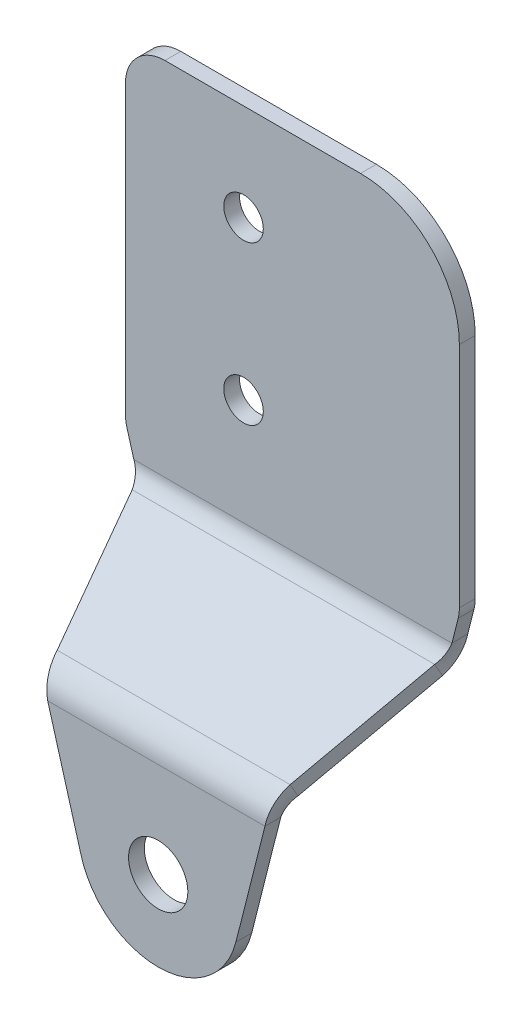
ISO-10303-21;
HEADER;
FILE_DESCRIPTION(('STEP AP214'),'2;1');
FILE_NAME('part.step','',(''),(''),'','','');
FILE_SCHEMA(('AUTOMOTIVE_DESIGN { 1 0 10303 214 1 1 1 1 }'));
ENDSEC;
DATA;
#1=APPLICATION_CONTEXT('core data for automotive mechanical design processes');
#2=APPLICATION_PROTOCOL_DEFINITION('international standard','automotive_design',2000,#1);
#3=PRODUCT_CONTEXT('',#1,'mechanical');
#4=PRODUCT('Part','Part','',(#3));
#5=PRODUCT_RELATED_PRODUCT_CATEGORY('part','',(#4));
#6=PRODUCT_DEFINITION_FORMATION('','',#4);
#7=PRODUCT_DEFINITION_CONTEXT('part definition',#1,'design');
#8=PRODUCT_DEFINITION('design','',#6,#7);
#9=PRODUCT_DEFINITION_SHAPE('','',#8);
#10=(LENGTH_UNIT() NAMED_UNIT(*) SI_UNIT(.MILLI.,.METRE.));
#11=(NAMED_UNIT(*) PLANE_ANGLE_UNIT() SI_UNIT($,.RADIAN.));
#12=(NAMED_UNIT(*) SI_UNIT($,.STERADIAN.) SOLID_ANGLE_UNIT());
#13=UNCERTAINTY_MEASURE_WITH_UNIT(LENGTH_MEASURE(1.E-05),#10,'distance_accuracy_value','');
#14=(GEOMETRIC_REPRESENTATION_CONTEXT(3) GLOBAL_UNCERTAINTY_ASSIGNED_CONTEXT((#13)) GLOBAL_UNIT_ASSIGNED_CONTEXT((#10,
#11,#12)) REPRESENTATION_CONTEXT('',''));
#15=CARTESIAN_POINT('',(0.,0.,0.));
#16=DIRECTION('',(0.,0.,1.));
#17=DIRECTION('',(1.,0.,0.));
#18=AXIS2_PLACEMENT_3D('',#15,#16,#17);
#19=CARTESIAN_POINT('',(280.129035475283,84.9102335013222,5.34114836653676));
#20=DIRECTION('',(0.,-0.86602540378444,-0.499999999999998));
#21=DIRECTION('',(-1.,0.,0.));
#22=AXIS2_PLACEMENT_3D('',#19,#20,#21);
#23=PLANE('',#22);
#24=DIRECTION('',(0.274438872254678,-0.480802273651959,0.832773966359832));
#25=VECTOR('',#24,1.);
#26=CARTESIAN_POINT('',(271.490097915792,92.6607239602693,-8.08309489193763));
#27=LINE('',#26,#25);
#28=CARTESIAN_POINT('',(272.256148777322,91.3186436896052,-5.75854367531156));
#29=VERTEX_POINT('',#28);
#30=CARTESIAN_POINT('',(274.120909693954,88.0516819754429,-0.100000000000003));
#31=VERTEX_POINT('',#30);
#32=EDGE_CURVE('E92',#29,#31,#27,.T.);
#33=ORIENTED_EDGE('',*,*,#32,.T.);
#34=DIRECTION('',(1.,0.,0.));
#35=VECTOR('',#34,1.);
#36=CARTESIAN_POINT('',(280.129035475283,88.0516819754429,-0.100000000000003));
#37=LINE('',#36,#35);
#38=CARTESIAN_POINT('',(285.903200810291,88.0516819754429,-0.100000000000003));
#39=VERTEX_POINT('',#38);
#40=EDGE_CURVE('E85',#31,#39,#37,.T.);
#41=ORIENTED_EDGE('',*,*,#40,.T.);
#42=DIRECTION('',(0.245522578997895,0.484695436125155,-0.839517121565528));
#43=VECTOR('',#42,1.);
#44=CARTESIAN_POINT('',(288.244841789054,92.6744042524836,-8.10678985311503));
#45=LINE('',#44,#43);
#46=CARTESIAN_POINT('',(287.558080979911,91.3186436896052,-5.75854367531156));
#47=VERTEX_POINT('',#46);
#48=EDGE_CURVE('E100',#39,#47,#45,.T.);
#49=ORIENTED_EDGE('',*,*,#48,.T.);
#50=DIRECTION('',(1.,0.,0.));
#51=VECTOR('',#50,1.);
#52=CARTESIAN_POINT('',(280.129035475283,91.3186436896052,-5.75854367531156));
#53=LINE('',#52,#51);
#54=EDGE_CURVE('E408',#29,#47,#53,.T.);
#55=ORIENTED_EDGE('',*,*,#54,.F.);
#56=EDGE_LOOP('',(#33,#41,#49,#55));
#57=FACE_BOUND('',#56,.T.);
#58=ADVANCED_FACE('F73',(#57),#23,.F.);
#59=CARTESIAN_POINT('',(280.129035475283,77.9017721451483,-6.25854367531156));
#60=DIRECTION('',(0.,0.,-1.));
#61=DIRECTION('',(-1.,0.,0.));
#62=AXIS2_PLACEMENT_3D('',#59,#60,#61);
#63=PLANE('',#62);
#64=CARTESIAN_POINT('',(277.387391499222,105.561844598402,-6.25854367531155));
#65=DIRECTION('',(0.,0.,1.));
#66=DIRECTION('',(1.,0.,0.));
#67=AXIS2_PLACEMENT_3D('',#64,#65,#66);
#68=CIRCLE('',#67,0.999999999999998);
#69=CARTESIAN_POINT('',(278.387391499222,105.561844598402,-6.25854367531155));
#70=VERTEX_POINT('',#69);
#71=EDGE_CURVE('E487',#70,#70,#68,.T.);
#72=ORIENTED_EDGE('',*,*,#71,.F.);
#73=EDGE_LOOP('',(#72));
#74=FACE_BOUND('',#73,.T.);
#75=CARTESIAN_POINT('',(277.387391499222,97.5618445984017,-6.25854367531158));
#76=DIRECTION('',(0.,0.,1.));
#77=DIRECTION('',(1.,0.,0.));
#78=AXIS2_PLACEMENT_3D('',#75,#76,#77);
#79=CIRCLE('',#78,0.999999999999998);
#80=CARTESIAN_POINT('',(278.387391499222,97.5618445984017,-6.25854367531158));
#81=VERTEX_POINT('',#80);
#82=EDGE_CURVE('E482',#81,#81,#79,.T.);
#83=ORIENTED_EDGE('',*,*,#82,.F.);
#84=EDGE_LOOP('',(#83));
#85=FACE_BOUND('',#84,.T.);
#86=DIRECTION('',(0.274438872254678,-0.961604547303922,0.));
#87=VECTOR('',#86,1.);
#88=CARTESIAN_POINT('',(271.490097915792,93.4027530630427,-6.25854367531156));
#89=LINE('',#88,#87);
#90=CARTESIAN_POINT('',(271.490097915792,93.4027530630427,-6.25854367531156));
#91=VERTEX_POINT('',#90);
#92=CARTESIAN_POINT('',(271.837735197542,92.1846690933896,-6.25854367531155));
#93=VERTEX_POINT('',#92);
#94=EDGE_CURVE('E479',#91,#93,#89,.T.);
#95=ORIENTED_EDGE('',*,*,#94,.T.);
#96=DIRECTION('',(1.,0.,0.));
#97=VECTOR('',#96,1.);
#98=CARTESIAN_POINT('',(280.129035475283,92.1846690933896,-6.25854367531155));
#99=LINE('',#98,#97);
#100=CARTESIAN_POINT('',(287.929401683654,92.1846690933896,-6.25854367531155));
#101=VERTEX_POINT('',#100);
#102=EDGE_CURVE('E468',#93,#101,#99,.T.);
#103=ORIENTED_EDGE('',*,*,#102,.T.);
#104=DIRECTION('',(0.245522578997895,0.969390872250313,0.));
#105=VECTOR('',#104,1.);
#106=CARTESIAN_POINT('',(288.244841789054,93.4301136474711,-6.25854367531155));
#107=LINE('',#106,#105);
#108=CARTESIAN_POINT('',(288.244841789054,93.4301136474711,-6.25854367531155));
#109=VERTEX_POINT('',#108);
#110=EDGE_CURVE('E485',#101,#109,#107,.T.);
#111=ORIENTED_EDGE('',*,*,#110,.T.);
#112=CARTESIAN_POINT('',(286.306060044553,93.9211588054669,-6.25854367531155));
#113=DIRECTION('',(0.,0.,1.));
#114=DIRECTION('',(1.,0.,0.));
#115=AXIS2_PLACEMENT_3D('',#112,#113,#114);
#116=CIRCLE('',#115,2.);
#117=CARTESIAN_POINT('',(288.306060044553,93.9211588054669,-6.25854367531155));
#118=VERTEX_POINT('',#117);
#119=EDGE_CURVE('E488',#109,#118,#116,.T.);
#120=ORIENTED_EDGE('',*,*,#119,.T.);
#121=DIRECTION('',(0.,1.,0.));
#122=VECTOR('',#121,1.);
#123=CARTESIAN_POINT('',(288.306060044553,77.9017721451483,-6.25854367531156));
#124=LINE('',#123,#122);
#125=CARTESIAN_POINT('',(288.306060044553,105.451630807552,-6.25854367531158));
#126=VERTEX_POINT('',#125);
#127=EDGE_CURVE('E1105',#118,#126,#124,.T.);
#128=ORIENTED_EDGE('',*,*,#127,.T.);
#129=CARTESIAN_POINT('',(283.306060044553,105.451630807552,-6.25854367531158));
#130=DIRECTION('',(0.,0.,1.));
#131=DIRECTION('',(1.,0.,0.));
#132=AXIS2_PLACEMENT_3D('',#129,#130,#131);
#133=CIRCLE('',#132,4.99999999999998);
#134=CARTESIAN_POINT('',(283.306060044553,110.451630807552,-6.25854367531155));
#135=VERTEX_POINT('',#134);
#136=EDGE_CURVE('E1108',#126,#135,#133,.T.);
#137=ORIENTED_EDGE('',*,*,#136,.T.);
#138=DIRECTION('',(-1.,0.,0.));
#139=VECTOR('',#138,1.);
#140=CARTESIAN_POINT('',(280.129035475283,110.451630807552,-6.25854367531155));
#141=LINE('',#140,#139);
#142=CARTESIAN_POINT('',(273.4133070104,110.451630807552,-6.25854367531155));
#143=VERTEX_POINT('',#142);
#144=EDGE_CURVE('E1111',#135,#143,#141,.T.);
#145=ORIENTED_EDGE('',*,*,#144,.T.);
#146=CARTESIAN_POINT('',(273.4133070104,108.451630807552,-6.25854367531156));
#147=DIRECTION('',(0.,0.,1.));
#148=DIRECTION('',(1.,0.,0.));
#149=AXIS2_PLACEMENT_3D('',#146,#147,#148);
#150=CIRCLE('',#149,2.);
#151=CARTESIAN_POINT('',(271.4133070104,108.451630807552,-6.25854367531156));
#152=VERTEX_POINT('',#151);
#153=EDGE_CURVE('E1040',#143,#152,#150,.T.);
#154=ORIENTED_EDGE('',*,*,#153,.T.);
#155=DIRECTION('',(0.,1.,0.));
#156=VECTOR('',#155,1.);
#157=CARTESIAN_POINT('',(271.4133070104,77.9017721451483,-6.25854367531156));
#158=LINE('',#157,#156);
#159=CARTESIAN_POINT('',(271.4133070104,93.9516308075518,-6.25854367531156));
#160=VERTEX_POINT('',#159);
#161=EDGE_CURVE('E1025',#152,#160,#158,.F.);
#162=ORIENTED_EDGE('',*,*,#161,.T.);
#163=CARTESIAN_POINT('',(273.4133070104,93.9516308075518,-6.25854367531156));
#164=DIRECTION('',(0.,0.,1.));
#165=DIRECTION('',(1.,0.,0.));
#166=AXIS2_PLACEMENT_3D('',#163,#164,#165);
#167=CIRCLE('',#166,1.99999999999998);
#168=EDGE_CURVE('E481',#160,#91,#167,.T.);
#169=ORIENTED_EDGE('',*,*,#168,.T.);
#170=EDGE_LOOP('',(#95,#103,#111,#120,#128,#137,#145,#154,#162,#169));
#171=FACE_BOUND('',#170,.T.);
#172=ADVANCED_FACE('F437',(#74,#85,#171),#63,.F.);
#173=CARTESIAN_POINT('',(273.4133070104,93.9516308075518,-7.05854367531156));
#174=DIRECTION('',(0.,0.,-1.));
#175=DIRECTION('',(-1.,0.,0.));
#176=AXIS2_PLACEMENT_3D('',#173,#174,#175);
#177=CYLINDRICAL_SURFACE('',#176,1.99999999999998);
#178=DIRECTION('',(0.,0.,-1.));
#179=VECTOR('',#178,1.);
#180=CARTESIAN_POINT('',(271.490097915792,93.4027530630427,-7.05854367531157));
#181=LINE('',#180,#179);
#182=CARTESIAN_POINT('',(271.490097915792,93.4027530630427,-7.05854367531157));
#183=VERTEX_POINT('',#182);
#184=EDGE_CURVE('E1031',#91,#183,#181,.T.);
#185=ORIENTED_EDGE('',*,*,#184,.F.);
#186=ORIENTED_EDGE('',*,*,#168,.F.);
#187=DIRECTION('',(0.,0.,-1.));
#188=VECTOR('',#187,1.);
#189=CARTESIAN_POINT('',(271.4133070104,93.9516308075518,-7.05854367531156));
#190=LINE('',#189,#188);
#191=CARTESIAN_POINT('',(271.4133070104,93.9516308075518,-7.05854367531156));
#192=VERTEX_POINT('',#191);
#193=EDGE_CURVE('E1023',#160,#192,#190,.T.);
#194=ORIENTED_EDGE('',*,*,#193,.T.);
#195=CARTESIAN_POINT('',(273.4133070104,93.9516308075518,-7.05854367531156));
#196=DIRECTION('',(0.,0.,1.));
#197=DIRECTION('',(-1.,0.,0.));
#198=AXIS2_PLACEMENT_3D('',#195,#196,#197);
#199=CIRCLE('',#198,1.99999999999998);
#200=EDGE_CURVE('E1073',#192,#183,#199,.T.);
#201=ORIENTED_EDGE('',*,*,#200,.T.);
#202=EDGE_LOOP('',(#185,#186,#194,#201));
#203=FACE_BOUND('',#202,.T.);
#204=ADVANCED_FACE('F441',(#203),#177,.T.);
#205=CARTESIAN_POINT('',(271.4133070104,108.451630807552,-7.05854367531156));
#206=DIRECTION('',(1.,0.,0.));
#207=DIRECTION('',(0.,-1.,0.));
#208=AXIS2_PLACEMENT_3D('',#205,#206,#207);
#209=PLANE('',#208);
#210=ORIENTED_EDGE('',*,*,#193,.F.);
#211=ORIENTED_EDGE('',*,*,#161,.F.);
#212=DIRECTION('',(0.,0.,-1.));
#213=VECTOR('',#212,1.);
#214=CARTESIAN_POINT('',(271.4133070104,108.451630807552,-7.05854367531156));
#215=LINE('',#214,#213);
#216=CARTESIAN_POINT('',(271.4133070104,108.451630807552,-7.05854367531156));
#217=VERTEX_POINT('',#216);
#218=EDGE_CURVE('E1032',#152,#217,#215,.T.);
#219=ORIENTED_EDGE('',*,*,#218,.T.);
#220=DIRECTION('',(0.,-1.,0.));
#221=VECTOR('',#220,1.);
#222=CARTESIAN_POINT('',(271.4133070104,108.451630807552,-7.05854367531156));
#223=LINE('',#222,#221);
#224=EDGE_CURVE('E1027',#217,#192,#223,.T.);
#225=ORIENTED_EDGE('',*,*,#224,.T.);
#226=EDGE_LOOP('',(#210,#211,#219,#225));
#227=FACE_BOUND('',#226,.T.);
#228=ADVANCED_FACE('F447',(#227),#209,.F.);
#229=CARTESIAN_POINT('',(273.4133070104,108.451630807552,-7.05854367531156));
#230=DIRECTION('',(0.,0.,-1.));
#231=DIRECTION('',(-1.,0.,0.));
#232=AXIS2_PLACEMENT_3D('',#229,#230,#231);
#233=CYLINDRICAL_SURFACE('',#232,2.);
#234=ORIENTED_EDGE('',*,*,#218,.F.);
#235=ORIENTED_EDGE('',*,*,#153,.F.);
#236=DIRECTION('',(0.,0.,-1.));
#237=VECTOR('',#236,1.);
#238=CARTESIAN_POINT('',(273.4133070104,110.451630807552,-7.05854367531156));
#239=LINE('',#238,#237);
#240=CARTESIAN_POINT('',(273.4133070104,110.451630807552,-7.05854367531156));
#241=VERTEX_POINT('',#240);
#242=EDGE_CURVE('E1058',#143,#241,#239,.T.);
#243=ORIENTED_EDGE('',*,*,#242,.T.);
#244=CARTESIAN_POINT('',(273.4133070104,108.451630807552,-7.05854367531156));
#245=DIRECTION('',(0.,0.,1.));
#246=DIRECTION('',(1.,0.,0.));
#247=AXIS2_PLACEMENT_3D('',#244,#245,#246);
#248=CIRCLE('',#247,2.);
#249=EDGE_CURVE('E1085',#241,#217,#248,.T.);
#250=ORIENTED_EDGE('',*,*,#249,.T.);
#251=EDGE_LOOP('',(#234,#235,#243,#250));
#252=FACE_BOUND('',#251,.T.);
#253=ADVANCED_FACE('F952',(#252),#233,.T.);
#254=CARTESIAN_POINT('',(273.4133070104,110.451630807552,-7.05854367531156));
#255=DIRECTION('',(0.,-1.,0.));
#256=DIRECTION('',(-1.,0.,0.));
#257=AXIS2_PLACEMENT_3D('',#254,#255,#256);
#258=PLANE('',#257);
#259=ORIENTED_EDGE('',*,*,#242,.F.);
#260=ORIENTED_EDGE('',*,*,#144,.F.);
#261=DIRECTION('',(0.,0.,-1.));
#262=VECTOR('',#261,1.);
#263=CARTESIAN_POINT('',(283.306060044553,110.451630807552,-7.05854367531156));
#264=LINE('',#263,#262);
#265=CARTESIAN_POINT('',(283.306060044553,110.451630807552,-7.05854367531156));
#266=VERTEX_POINT('',#265);
#267=EDGE_CURVE('E1056',#135,#266,#264,.T.);
#268=ORIENTED_EDGE('',*,*,#267,.T.);
#269=DIRECTION('',(-1.,0.,0.));
#270=VECTOR('',#269,1.);
#271=CARTESIAN_POINT('',(273.4133070104,110.451630807552,-7.05854367531156));
#272=LINE('',#271,#270);
#273=EDGE_CURVE('E1088',#266,#241,#272,.T.);
#274=ORIENTED_EDGE('',*,*,#273,.T.);
#275=EDGE_LOOP('',(#259,#260,#268,#274));
#276=FACE_BOUND('',#275,.T.);
#277=ADVANCED_FACE('F939',(#276),#258,.F.);
#278=CARTESIAN_POINT('',(283.306060044553,105.451630807552,-7.05854367531156));
#279=DIRECTION('',(0.,0.,-1.));
#280=DIRECTION('',(-1.,0.,0.));
#281=AXIS2_PLACEMENT_3D('',#278,#279,#280);
#282=CYLINDRICAL_SURFACE('',#281,4.99999999999998);
#283=ORIENTED_EDGE('',*,*,#267,.F.);
#284=ORIENTED_EDGE('',*,*,#136,.F.);
#285=DIRECTION('',(0.,0.,-1.));
#286=VECTOR('',#285,1.);
#287=CARTESIAN_POINT('',(288.306060044553,105.451630807552,-7.05854367531156));
#288=LINE('',#287,#286);
#289=CARTESIAN_POINT('',(288.306060044553,105.451630807552,-7.05854367531156));
#290=VERTEX_POINT('',#289);
#291=EDGE_CURVE('E1054',#126,#290,#288,.T.);
#292=ORIENTED_EDGE('',*,*,#291,.T.);
#293=CARTESIAN_POINT('',(283.306060044553,105.451630807552,-7.05854367531156));
#294=DIRECTION('',(0.,0.,1.));
#295=DIRECTION('',(1.,0.,0.));
#296=AXIS2_PLACEMENT_3D('',#293,#294,#295);
#297=CIRCLE('',#296,4.99999999999998);
#298=EDGE_CURVE('E1091',#290,#266,#297,.T.);
#299=ORIENTED_EDGE('',*,*,#298,.T.);
#300=EDGE_LOOP('',(#283,#284,#292,#299));
#301=FACE_BOUND('',#300,.T.);
#302=ADVANCED_FACE('F926',(#301),#282,.T.);
#303=CARTESIAN_POINT('',(288.306060044553,105.451630807552,-7.05854367531156));
#304=DIRECTION('',(-1.,0.,0.));
#305=DIRECTION('',(0.,1.,0.));
#306=AXIS2_PLACEMENT_3D('',#303,#304,#305);
#307=PLANE('',#306);
#308=ORIENTED_EDGE('',*,*,#291,.F.);
#309=ORIENTED_EDGE('',*,*,#127,.F.);
#310=DIRECTION('',(0.,0.,-1.));
#311=VECTOR('',#310,1.);
#312=CARTESIAN_POINT('',(288.306060044553,93.9211588054669,-7.05854367531156));
#313=LINE('',#312,#311);
#314=CARTESIAN_POINT('',(288.306060044553,93.9211588054669,-7.05854367531156));
#315=VERTEX_POINT('',#314);
#316=EDGE_CURVE('E1051',#118,#315,#313,.T.);
#317=ORIENTED_EDGE('',*,*,#316,.T.);
#318=DIRECTION('',(0.,1.,0.));
#319=VECTOR('',#318,1.);
#320=CARTESIAN_POINT('',(288.306060044553,105.451630807552,-7.05854367531156));
#321=LINE('',#320,#319);
#322=EDGE_CURVE('E1094',#315,#290,#321,.T.);
#323=ORIENTED_EDGE('',*,*,#322,.T.);
#324=EDGE_LOOP('',(#308,#309,#317,#323));
#325=FACE_BOUND('',#324,.T.);
#326=ADVANCED_FACE('F914',(#325),#307,.F.);
#327=CARTESIAN_POINT('',(286.306060044553,93.9211588054669,-7.05854367531156));
#328=DIRECTION('',(0.,0.,-1.));
#329=DIRECTION('',(-1.,0.,0.));
#330=AXIS2_PLACEMENT_3D('',#327,#328,#329);
#331=CYLINDRICAL_SURFACE('',#330,2.);
#332=ORIENTED_EDGE('',*,*,#316,.F.);
#333=ORIENTED_EDGE('',*,*,#119,.F.);
#334=DIRECTION('',(0.,0.,-1.));
#335=VECTOR('',#334,1.);
#336=CARTESIAN_POINT('',(288.244841789054,93.4301136474711,-7.05854367531156));
#337=LINE('',#336,#335);
#338=CARTESIAN_POINT('',(288.244841789054,93.4301136474711,-7.05854367531156));
#339=VERTEX_POINT('',#338);
#340=EDGE_CURVE('E1048',#109,#339,#337,.T.);
#341=ORIENTED_EDGE('',*,*,#340,.T.);
#342=CARTESIAN_POINT('',(286.306060044553,93.9211588054669,-7.05854367531156));
#343=DIRECTION('',(0.,0.,1.));
#344=DIRECTION('',(1.,0.,0.));
#345=AXIS2_PLACEMENT_3D('',#342,#343,#344);
#346=CIRCLE('',#345,2.);
#347=EDGE_CURVE('E1065',#339,#315,#346,.T.);
#348=ORIENTED_EDGE('',*,*,#347,.T.);
#349=EDGE_LOOP('',(#332,#333,#341,#348));
#350=FACE_BOUND('',#349,.T.);
#351=ADVANCED_FACE('F903',(#350),#331,.T.);
#352=CARTESIAN_POINT('',(288.244841789054,93.4301136474711,-7.05854367531156));
#353=DIRECTION('',(-0.969390872250313,0.245522578997895,0.));
#354=DIRECTION('',(0.245522578997895,0.969390872250313,0.));
#355=AXIS2_PLACEMENT_3D('',#352,#353,#354);
#356=PLANE('',#355);
#357=CARTESIAN_POINT('',(287.929401683654,92.1846690933897,-7.05854367531156));
#358=CARTESIAN_POINT('',(287.929401683654,92.1846690933897,-6.25854367531156));
#359=B_SPLINE_CURVE_WITH_KNOTS('',1,(#357,#358),.UNSPECIFIED.,.F.,.F.,(2,2),(0.,1.),.UNSPECIFIED.);
#360=CARTESIAN_POINT('',(287.929401683654,92.1846690933897,-7.05854367531156));
#361=VERTEX_POINT('',#360);
#362=EDGE_CURVE('E404',#361,#101,#359,.T.);
#363=ORIENTED_EDGE('',*,*,#362,.F.);
#364=DIRECTION('',(0.245522578997895,0.969390872250313,0.));
#365=VECTOR('',#364,1.);
#366=CARTESIAN_POINT('',(288.244841789054,93.4301136474711,-7.05854367531156));
#367=LINE('',#366,#365);
#368=EDGE_CURVE('E1063',#361,#339,#367,.T.);
#369=ORIENTED_EDGE('',*,*,#368,.T.);
#370=ORIENTED_EDGE('',*,*,#340,.F.);
#371=ORIENTED_EDGE('',*,*,#110,.F.);
#372=EDGE_LOOP('',(#363,#369,#370,#371));
#373=FACE_BOUND('',#372,.T.);
#374=ADVANCED_FACE('F453',(#373),#356,.F.);
#375=CARTESIAN_POINT('',(277.387391499222,97.5618445984017,-7.05854367531156));
#376=DIRECTION('',(0.,0.,-1.));
#377=DIRECTION('',(-1.,0.,0.));
#378=AXIS2_PLACEMENT_3D('',#375,#376,#377);
#379=CYLINDRICAL_SURFACE('',#378,0.999999999999998);
#380=CARTESIAN_POINT('',(277.387391499222,97.5618445984017,-7.05854367531156));
#381=DIRECTION('',(0.,0.,1.));
#382=DIRECTION('',(1.,0.,0.));
#383=AXIS2_PLACEMENT_3D('',#380,#381,#382);
#384=CIRCLE('',#383,0.999999999999998);
#385=CARTESIAN_POINT('',(278.387391499222,97.5618445984017,-7.05854367531156));
#386=VERTEX_POINT('',#385);
#387=EDGE_CURVE('E1047',#386,#386,#384,.T.);
#388=ORIENTED_EDGE('',*,*,#387,.F.);
#389=EDGE_LOOP('',(#388));
#390=FACE_BOUND('',#389,.T.);
#391=ORIENTED_EDGE('',*,*,#82,.T.);
#392=EDGE_LOOP('',(#391));
#393=FACE_BOUND('',#392,.T.);
#394=ADVANCED_FACE('F379',(#390,#393),#379,.F.);
#395=CARTESIAN_POINT('',(271.490097915792,93.4027530630427,-7.05854367531157));
#396=DIRECTION('',(0.961604547303922,0.274438872254678,0.));
#397=DIRECTION('',(0.274438872254678,-0.961604547303922,0.));
#398=AXIS2_PLACEMENT_3D('',#395,#396,#397);
#399=PLANE('',#398);
#400=CARTESIAN_POINT('',(271.837735197542,92.1846690933897,-6.25854367531156));
#401=CARTESIAN_POINT('',(271.837735197542,92.1846690933897,-7.05854367531156));
#402=B_SPLINE_CURVE_WITH_KNOTS('',1,(#400,#401),.UNSPECIFIED.,.F.,.F.,(2,2),(0.,1.),.UNSPECIFIED.);
#403=CARTESIAN_POINT('',(271.837735197542,92.1846690933896,-7.05854367531157));
#404=VERTEX_POINT('',#403);
#405=EDGE_CURVE('E476',#93,#404,#402,.T.);
#406=ORIENTED_EDGE('',*,*,#405,.F.);
#407=ORIENTED_EDGE('',*,*,#94,.F.);
#408=ORIENTED_EDGE('',*,*,#184,.T.);
#409=DIRECTION('',(0.274438872254678,-0.961604547303922,0.));
#410=VECTOR('',#409,1.);
#411=CARTESIAN_POINT('',(271.490097915792,93.4027530630427,-7.05854367531157));
#412=LINE('',#411,#410);
#413=EDGE_CURVE('E1071',#183,#404,#412,.T.);
#414=ORIENTED_EDGE('',*,*,#413,.T.);
#415=EDGE_LOOP('',(#406,#407,#408,#414));
#416=FACE_BOUND('',#415,.T.);
#417=ADVANCED_FACE('F456',(#416),#399,.F.);
#418=CARTESIAN_POINT('',(277.387391499222,105.561844598402,-7.05854367531157));
#419=DIRECTION('',(0.,0.,-1.));
#420=DIRECTION('',(-1.,0.,0.));
#421=AXIS2_PLACEMENT_3D('',#418,#419,#420);
#422=CYLINDRICAL_SURFACE('',#421,0.999999999999998);
#423=CARTESIAN_POINT('',(277.387391499222,105.561844598402,-7.05854367531157));
#424=DIRECTION('',(0.,0.,1.));
#425=DIRECTION('',(1.,0.,0.));
#426=AXIS2_PLACEMENT_3D('',#423,#424,#425);
#427=CIRCLE('',#426,0.999999999999998);
#428=CARTESIAN_POINT('',(278.387391499222,105.561844598402,-7.05854367531157));
#429=VERTEX_POINT('',#428);
#430=EDGE_CURVE('E1052',#429,#429,#427,.T.);
#431=ORIENTED_EDGE('',*,*,#430,.F.);
#432=EDGE_LOOP('',(#431));
#433=FACE_BOUND('',#432,.T.);
#434=ORIENTED_EDGE('',*,*,#71,.T.);
#435=EDGE_LOOP('',(#434));
#436=FACE_BOUND('',#435,.T.);
#437=ADVANCED_FACE('F459',(#433,#436),#422,.F.);
#438=CARTESIAN_POINT('',(280.129035475283,77.9017721451483,-7.05854367531156));
#439=DIRECTION('',(0.,0.,-1.));
#440=DIRECTION('',(-1.,0.,0.));
#441=AXIS2_PLACEMENT_3D('',#438,#439,#440);
#442=PLANE('',#441);
#443=DIRECTION('',(1.,0.,0.));
#444=VECTOR('',#443,1.);
#445=CARTESIAN_POINT('',(280.129035475283,92.1846690933896,-7.05854367531157));
#446=LINE('',#445,#444);
#447=EDGE_CURVE('E1062',#404,#361,#446,.T.);
#448=ORIENTED_EDGE('',*,*,#447,.F.);
#449=ORIENTED_EDGE('',*,*,#413,.F.);
#450=ORIENTED_EDGE('',*,*,#200,.F.);
#451=ORIENTED_EDGE('',*,*,#224,.F.);
#452=ORIENTED_EDGE('',*,*,#249,.F.);
#453=ORIENTED_EDGE('',*,*,#273,.F.);
#454=ORIENTED_EDGE('',*,*,#298,.F.);
#455=ORIENTED_EDGE('',*,*,#322,.F.);
#456=ORIENTED_EDGE('',*,*,#347,.F.);
#457=ORIENTED_EDGE('',*,*,#368,.F.);
#458=EDGE_LOOP('',(#448,#449,#450,#451,#452,#453,#454,#455,#456,#457));
#459=FACE_BOUND('',#458,.T.);
#460=ORIENTED_EDGE('',*,*,#387,.T.);
#461=EDGE_LOOP('',(#460));
#462=FACE_BOUND('',#461,.T.);
#463=ORIENTED_EDGE('',*,*,#430,.T.);
#464=EDGE_LOOP('',(#463));
#465=FACE_BOUND('',#464,.T.);
#466=ADVANCED_FACE('F846',(#459,#462,#465),#442,.T.);
#467=CARTESIAN_POINT('',(280.129035475283,84.2174131782946,4.94114836653677));
#468=DIRECTION('',(0.,-0.86602540378444,-0.499999999999998));
#469=DIRECTION('',(-1.,0.,0.));
#470=AXIS2_PLACEMENT_3D('',#467,#468,#469);
#471=PLANE('',#470);
#472=DIRECTION('',(1.,0.,0.));
#473=VECTOR('',#472,1.);
#474=CARTESIAN_POINT('',(280.129035475283,87.3588616524153,-0.5));
#475=LINE('',#474,#473);
#476=CARTESIAN_POINT('',(274.120909693954,87.3588616524153,-0.5));
#477=VERTEX_POINT('',#476);
#478=CARTESIAN_POINT('',(285.903200810291,87.3588616524153,-0.500000000000006));
#479=VERTEX_POINT('',#478);
#480=EDGE_CURVE('E230',#477,#479,#475,.T.);
#481=ORIENTED_EDGE('',*,*,#480,.F.);
#482=DIRECTION('',(0.274438872254678,-0.480802273651959,0.832773966359832));
#483=VECTOR('',#482,1.);
#484=CARTESIAN_POINT('',(271.490097915792,91.9679036372418,-8.48309489193763));
#485=LINE('',#484,#483);
#486=CARTESIAN_POINT('',(272.256148777322,90.6258233665776,-6.15854367531156));
#487=VERTEX_POINT('',#486);
#488=EDGE_CURVE('E534',#487,#477,#485,.T.);
#489=ORIENTED_EDGE('',*,*,#488,.F.);
#490=DIRECTION('',(1.,0.,0.));
#491=VECTOR('',#490,1.);
#492=CARTESIAN_POINT('',(280.129035475283,90.6258233665776,-6.15854367531156));
#493=LINE('',#492,#491);
#494=CARTESIAN_POINT('',(287.558080979911,90.6258233665776,-6.15854367531156));
#495=VERTEX_POINT('',#494);
#496=EDGE_CURVE('E415',#487,#495,#493,.T.);
#497=ORIENTED_EDGE('',*,*,#496,.T.);
#498=DIRECTION('',(0.245522578997895,0.484695436125155,-0.839517121565528));
#499=VECTOR('',#498,1.);
#500=CARTESIAN_POINT('',(288.244841789054,91.981583929456,-8.50678985311502));
#501=LINE('',#500,#499);
#502=EDGE_CURVE('E497',#479,#495,#501,.T.);
#503=ORIENTED_EDGE('',*,*,#502,.F.);
#504=EDGE_LOOP('',(#481,#489,#497,#503));
#505=FACE_BOUND('',#504,.T.);
#506=ADVANCED_FACE('F433',(#505),#471,.T.);
#507=CARTESIAN_POINT('',(288.244841789054,91.981583929456,-8.50678985311502));
#508=DIRECTION('',(-0.969390872250313,0.122761289498947,-0.212628790614849));
#509=DIRECTION('',(0.245522578997895,0.484695436125155,-0.839517121565528));
#510=AXIS2_PLACEMENT_3D('',#507,#508,#509);
#511=PLANE('',#510);
#512=CARTESIAN_POINT('',(285.903200810291,87.3588616524153,-0.500000000000006));
#513=CARTESIAN_POINT('',(285.903200810291,88.0516819754429,-0.100000000000011));
#514=B_SPLINE_CURVE_WITH_KNOTS('',1,(#512,#513),.UNSPECIFIED.,.F.,.F.,(2,2),(0.,1.),.UNSPECIFIED.);
#515=EDGE_CURVE('E512',#479,#39,#514,.T.);
#516=ORIENTED_EDGE('',*,*,#515,.F.);
#517=ORIENTED_EDGE('',*,*,#502,.T.);
#518=CARTESIAN_POINT('',(287.558080979911,91.3186436896052,-5.75854367531156));
#519=CARTESIAN_POINT('',(287.558080979911,90.6258233665776,-6.15854367531156));
#520=B_SPLINE_CURVE_WITH_KNOTS('',1,(#518,#519),.UNSPECIFIED.,.F.,.F.,(2,2),(0.,1.),.UNSPECIFIED.);
#521=EDGE_CURVE('E419',#495,#47,#520,.F.);
#522=ORIENTED_EDGE('',*,*,#521,.T.);
#523=ORIENTED_EDGE('',*,*,#48,.F.);
#524=EDGE_LOOP('',(#516,#517,#522,#523));
#525=FACE_BOUND('',#524,.T.);
#526=ADVANCED_FACE('F424',(#525),#511,.F.);
#527=CARTESIAN_POINT('',(271.490097915792,91.9679036372418,-8.48309489193763));
#528=DIRECTION('',(0.961604547303922,0.137219436127339,-0.237671035158504));
#529=DIRECTION('',(0.274438872254678,-0.480802273651959,0.832773966359832));
#530=AXIS2_PLACEMENT_3D('',#527,#528,#529);
#531=PLANE('',#530);
#532=CARTESIAN_POINT('',(274.120909693954,88.0516819754429,-0.100000000000011));
#533=CARTESIAN_POINT('',(274.120909693954,87.3588616524153,-0.500000000000006));
#534=B_SPLINE_CURVE_WITH_KNOTS('',1,(#532,#533),.UNSPECIFIED.,.F.,.F.,(2,2),(0.,1.),.UNSPECIFIED.);
#535=EDGE_CURVE('E12',#31,#477,#534,.T.);
#536=ORIENTED_EDGE('',*,*,#535,.F.);
#537=ORIENTED_EDGE('',*,*,#32,.F.);
#538=CARTESIAN_POINT('',(272.256148777322,90.6258233665776,-6.15854367531156));
#539=CARTESIAN_POINT('',(272.256148777322,91.3186436896052,-5.75854367531156));
#540=B_SPLINE_CURVE_WITH_KNOTS('',1,(#538,#539),.UNSPECIFIED.,.F.,.F.,(2,2),(0.,1.),.UNSPECIFIED.);
#541=EDGE_CURVE('E538',#29,#487,#540,.F.);
#542=ORIENTED_EDGE('',*,*,#541,.T.);
#543=ORIENTED_EDGE('',*,*,#488,.T.);
#544=EDGE_LOOP('',(#536,#537,#542,#543));
#545=FACE_BOUND('',#544,.T.);
#546=ADVANCED_FACE('F75',(#545),#531,.F.);
#547=CARTESIAN_POINT('',(272.256148777322,90.6258233665776,-6.15854367531156));
#548=CARTESIAN_POINT('',(272.186375570149,90.7829877171138,-6.43076031557868));
#549=CARTESIAN_POINT('',(272.116677584062,91.0125991887545,-6.66030976944405));
#550=CARTESIAN_POINT('',(271.977206390802,91.5567389980248,-6.97446903480303));
#551=CARTESIAN_POINT('',(271.907508404715,91.8703403923174,-7.05854367531156));
#552=CARTESIAN_POINT('',(271.837735197542,92.1846690933897,-7.05854367531156));
#553=CARTESIAN_POINT('',(272.256148777322,91.3186436896052,-5.75854367531156));
#554=CARTESIAN_POINT('',(272.186379149811,91.4059527381261,-5.90976738331023));
#555=CARTESIAN_POINT('',(272.116677584062,91.5335191463701,-6.03730261649628));
#556=CARTESIAN_POINT('',(271.977206390802,91.8358190404092,-6.21183554169571));
#557=CARTESIAN_POINT('',(271.907504825053,92.0100509963478,-6.25854367531156));
#558=CARTESIAN_POINT('',(271.837735197542,92.1846690933897,-6.25854367531156));
#559=B_SPLINE_SURFACE_WITH_KNOTS('',1,3,((#547,#548,#549,#550,#551,#552),(#553,#554,#555,#556,
#557,#558)),.UNSPECIFIED.,.F.,.F.,.F.,(2,2),(4,2,4),(0.,1.),(0.,0.5,1.),.UNSPECIFIED.);
#560=CARTESIAN_POINT('',(272.256148777322,91.3186436896052,-5.75854367531156));
#561=CARTESIAN_POINT('',(272.186379149811,91.4059527381261,-5.90976738331023));
#562=CARTESIAN_POINT('',(272.116677584062,91.5335191463701,-6.03730261649628));
#563=CARTESIAN_POINT('',(271.977206390802,91.8358190404092,-6.21183554169571));
#564=CARTESIAN_POINT('',(271.907504825053,92.0100509963478,-6.25854367531156));
#565=CARTESIAN_POINT('',(271.837735197542,92.1846690933897,-6.25854367531156));
#566=B_SPLINE_CURVE_WITH_KNOTS('',3,(#560,#561,#562,#563,#564,#565),.UNSPECIFIED.,.F.,.F.,(4,2,
4),(0.,0.5,1.),.UNSPECIFIED.);
#567=EDGE_CURVE('E323',#29,#93,#566,.T.);
#568=CARTESIAN_POINT('',(271.837735197542,92.1846690933897,-7.05854367531156));
#569=CARTESIAN_POINT('',(271.907508404715,91.8703403923174,-7.05854367531156));
#570=CARTESIAN_POINT('',(271.977206390802,91.5567389980248,-6.97446903480303));
#571=CARTESIAN_POINT('',(272.116677584062,91.0125991887545,-6.66030976944405));
#572=CARTESIAN_POINT('',(272.186375570149,90.7829877171138,-6.43076031557868));
#573=CARTESIAN_POINT('',(272.256148777322,90.6258233665776,-6.15854367531156));
#574=B_SPLINE_CURVE_WITH_KNOTS('',3,(#568,#569,#570,#571,#572,#573),.UNSPECIFIED.,.F.,.F.,(4,2,
4),(0.,0.5,1.),.UNSPECIFIED.);
#575=EDGE_CURVE('E316',#487,#404,#574,.F.);
#576=ORIENTED_EDGE('',*,*,#541,.F.);
#577=ORIENTED_EDGE('',*,*,#567,.T.);
#578=ORIENTED_EDGE('',*,*,#405,.T.);
#579=ORIENTED_EDGE('',*,*,#575,.F.);
#580=EDGE_LOOP('',(#576,#577,#578,#579));
#581=FACE_BOUND('',#580,.T.);
#582=ADVANCED_FACE('F338',(#581),#559,.T.);
#583=CARTESIAN_POINT('',(287.929401683654,92.1846690933897,-7.05854367531156));
#584=CARTESIAN_POINT('',(287.867481185939,91.8703386850381,-7.05854367531156));
#585=CARTESIAN_POINT('',(287.805628115739,91.5567389980248,-6.97446903480303));
#586=CARTESIAN_POINT('',(287.681854547825,91.0125991887545,-6.66030976944405));
#587=CARTESIAN_POINT('',(287.620001477626,90.7829885707535,-6.43076179412595));
#588=CARTESIAN_POINT('',(287.558080979911,90.6258233665776,-6.15854367531156));
#589=CARTESIAN_POINT('',(287.929401683654,92.1846690933897,-6.25854367531156));
#590=CARTESIAN_POINT('',(287.867483789194,92.0100484304431,-6.25854367531156));
#591=CARTESIAN_POINT('',(287.805628115739,91.8358190404092,-6.21183554169571));
#592=CARTESIAN_POINT('',(287.681854547825,91.5335191463701,-6.03730261649628));
#593=CARTESIAN_POINT('',(287.61999887437,91.4059540210785,-5.90976960544891));
#594=CARTESIAN_POINT('',(287.558080979911,91.3186436896052,-5.75854367531156));
#595=B_SPLINE_SURFACE_WITH_KNOTS('',1,3,((#583,#584,#585,#586,#587,#588),(#589,#590,#591,#592,
#593,#594)),.UNSPECIFIED.,.F.,.F.,.F.,(2,2),(4,2,4),(0.,1.),(0.,0.5,1.),.UNSPECIFIED.);
#596=CARTESIAN_POINT('',(287.929401683654,92.1846690933897,-6.25854367531156));
#597=CARTESIAN_POINT('',(287.867483789194,92.0100484304431,-6.25854367531156));
#598=CARTESIAN_POINT('',(287.805628115739,91.8358190404092,-6.21183554169571));
#599=CARTESIAN_POINT('',(287.681854547825,91.5335191463701,-6.03730261649628));
#600=CARTESIAN_POINT('',(287.61999887437,91.4059540210785,-5.90976960544891));
#601=CARTESIAN_POINT('',(287.558080979911,91.3186436896052,-5.75854367531156));
#602=B_SPLINE_CURVE_WITH_KNOTS('',3,(#596,#597,#598,#599,#600,#601),.UNSPECIFIED.,.F.,.F.,(4,2,
4),(0.,0.5,1.),.UNSPECIFIED.);
#603=EDGE_CURVE('E541',#101,#47,#602,.T.);
#604=CARTESIAN_POINT('',(287.558080979911,90.6258233665776,-6.15854367531156));
#605=CARTESIAN_POINT('',(287.620001477626,90.7829885707535,-6.43076179412595));
#606=CARTESIAN_POINT('',(287.681854547825,91.0125991887545,-6.66030976944405));
#607=CARTESIAN_POINT('',(287.805628115739,91.5567389980248,-6.97446903480303));
#608=CARTESIAN_POINT('',(287.867481185939,91.8703386850381,-7.05854367531156));
#609=CARTESIAN_POINT('',(287.929401683654,92.1846690933897,-7.05854367531156));
#610=B_SPLINE_CURVE_WITH_KNOTS('',3,(#604,#605,#606,#607,#608,#609),.UNSPECIFIED.,.F.,.F.,(4,2,
4),(0.,0.5,1.),.UNSPECIFIED.);
#611=EDGE_CURVE('E362',#361,#495,#610,.F.);
#612=ORIENTED_EDGE('',*,*,#603,.T.);
#613=ORIENTED_EDGE('',*,*,#521,.F.);
#614=ORIENTED_EDGE('',*,*,#611,.F.);
#615=ORIENTED_EDGE('',*,*,#362,.T.);
#616=EDGE_LOOP('',(#612,#613,#614,#615));
#617=FACE_BOUND('',#616,.T.);
#618=ADVANCED_FACE('F368',(#617),#595,.T.);
#619=CARTESIAN_POINT('',(263.729008969263,92.1846690933897,-5.25854367531156));
#620=DIRECTION('',(1.,0.,0.));
#621=DIRECTION('',(0.,-0.86602540378444,-0.499999999999998));
#622=AXIS2_PLACEMENT_3D('',#619,#620,#621);
#623=CYLINDRICAL_SURFACE('',#622,1.8);
#624=ORIENTED_EDGE('',*,*,#447,.T.);
#625=ORIENTED_EDGE('',*,*,#611,.T.);
#626=ORIENTED_EDGE('',*,*,#496,.F.);
#627=ORIENTED_EDGE('',*,*,#575,.T.);
#628=EDGE_LOOP('',(#624,#625,#626,#627));
#629=FACE_BOUND('',#628,.T.);
#630=ADVANCED_FACE('F290',(#629),#623,.T.);
#631=CARTESIAN_POINT('',(263.729008969263,92.1846690933897,-5.25854367531156));
#632=DIRECTION('',(1.,0.,0.));
#633=DIRECTION('',(0.,-0.86602540378444,-0.499999999999998));
#634=AXIS2_PLACEMENT_3D('',#631,#632,#633);
#635=CYLINDRICAL_SURFACE('',#634,1.);
#636=ORIENTED_EDGE('',*,*,#102,.F.);
#637=ORIENTED_EDGE('',*,*,#567,.F.);
#638=ORIENTED_EDGE('',*,*,#54,.T.);
#639=ORIENTED_EDGE('',*,*,#603,.F.);
#640=EDGE_LOOP('',(#636,#637,#638,#639));
#641=FACE_BOUND('',#640,.T.);
#642=ADVANCED_FACE('F328',(#641),#635,.F.);
#643=CARTESIAN_POINT('',(280.129035475283,81.6760158720647,0.));
#644=DIRECTION('',(0.,0.,-1.));
#645=DIRECTION('',(-1.,0.,0.));
#646=AXIS2_PLACEMENT_3D('',#643,#644,#645);
#647=CYLINDRICAL_SURFACE('',#646,4.05483010831053);
#648=DIRECTION('',(0.,0.,-1.));
#649=VECTOR('',#648,1.);
#650=CARTESIAN_POINT('',(284.059750770805,80.680463526474,0.));
#651=LINE('',#650,#649);
#652=CARTESIAN_POINT('',(284.059750770805,80.680463526474,0.8));
#653=VERTEX_POINT('',#652);
#654=CARTESIAN_POINT('',(284.059750770805,80.680463526474,0.));
#655=VERTEX_POINT('',#654);
#656=EDGE_CURVE('E218',#653,#655,#651,.T.);
#657=ORIENTED_EDGE('',*,*,#656,.F.);
#658=CARTESIAN_POINT('',(280.129035475283,81.6760158720647,0.8));
#659=DIRECTION('',(0.,0.,1.));
#660=DIRECTION('',(1.,0.,0.));
#661=AXIS2_PLACEMENT_3D('',#658,#659,#660);
#662=CIRCLE('',#661,4.05483010831053);
#663=CARTESIAN_POINT('',(276.199648246891,80.6752345689775,0.8));
#664=VERTEX_POINT('',#663);
#665=EDGE_CURVE('E558',#664,#653,#662,.T.);
#666=ORIENTED_EDGE('',*,*,#665,.F.);
#667=DIRECTION('',(0.,0.,-1.));
#668=VECTOR('',#667,1.);
#669=CARTESIAN_POINT('',(276.199648246891,80.6752345689775,0.));
#670=LINE('',#669,#668);
#671=CARTESIAN_POINT('',(276.199648246891,80.6752345689775,0.));
#672=VERTEX_POINT('',#671);
#673=EDGE_CURVE('E260',#664,#672,#670,.T.);
#674=ORIENTED_EDGE('',*,*,#673,.T.);
#675=CARTESIAN_POINT('',(280.129035475283,81.6760158720647,0.));
#676=DIRECTION('',(0.,0.,1.));
#677=DIRECTION('',(-1.,0.,0.));
#678=AXIS2_PLACEMENT_3D('',#675,#676,#677);
#679=CIRCLE('',#678,4.05483010831053);
#680=EDGE_CURVE('E258',#672,#655,#679,.T.);
#681=ORIENTED_EDGE('',*,*,#680,.T.);
#682=EDGE_LOOP('',(#657,#666,#674,#681));
#683=FACE_BOUND('',#682,.T.);
#684=ADVANCED_FACE('F337',(#683),#647,.T.);
#685=CARTESIAN_POINT('',(280.129035475283,81.6760158720647,0.));
#686=DIRECTION('',(0.,0.,-1.));
#687=DIRECTION('',(-1.,0.,0.));
#688=AXIS2_PLACEMENT_3D('',#685,#686,#687);
#689=CYLINDRICAL_SURFACE('',#688,1.50000000000002);
#690=CARTESIAN_POINT('',(280.129035475283,81.6760158720647,0.));
#691=DIRECTION('',(0.,0.,1.));
#692=DIRECTION('',(1.,0.,0.));
#693=AXIS2_PLACEMENT_3D('',#690,#691,#692);
#694=CIRCLE('',#693,1.50000000000002);
#695=CARTESIAN_POINT('',(281.629035475283,81.6760158720647,0.));
#696=VERTEX_POINT('',#695);
#697=EDGE_CURVE('E243',#696,#696,#694,.T.);
#698=ORIENTED_EDGE('',*,*,#697,.F.);
#699=EDGE_LOOP('',(#698));
#700=FACE_BOUND('',#699,.T.);
#701=CARTESIAN_POINT('',(280.129035475283,81.6760158720647,0.8));
#702=DIRECTION('',(0.,0.,1.));
#703=DIRECTION('',(1.,0.,0.));
#704=AXIS2_PLACEMENT_3D('',#701,#702,#703);
#705=CIRCLE('',#704,1.50000000000002);
#706=CARTESIAN_POINT('',(281.629035475283,81.6760158720647,0.8));
#707=VERTEX_POINT('',#706);
#708=EDGE_CURVE('E255',#707,#707,#705,.T.);
#709=ORIENTED_EDGE('',*,*,#708,.T.);
#710=EDGE_LOOP('',(#709));
#711=FACE_BOUND('',#710,.T.);
#712=ADVANCED_FACE('F571',(#700,#711),#689,.F.);
#713=CARTESIAN_POINT('',(280.129035475283,81.6760158720647,0.));
#714=DIRECTION('',(0.,0.,-1.));
#715=DIRECTION('',(-1.,0.,0.));
#716=AXIS2_PLACEMENT_3D('',#713,#714,#715);
#717=PLANE('',#716);
#718=ORIENTED_EDGE('',*,*,#697,.T.);
#719=EDGE_LOOP('',(#718));
#720=FACE_BOUND('',#719,.T.);
#721=DIRECTION('',(0.274438872254678,-0.961604547303922,0.));
#722=VECTOR('',#721,1.);
#723=CARTESIAN_POINT('',(271.490097915792,97.1769967899591,0.));
#724=LINE('',#723,#722);
#725=CARTESIAN_POINT('',(274.539323273733,86.4928362486309,0.));
#726=VERTEX_POINT('',#725);
#727=EDGE_CURVE('E241',#726,#672,#724,.T.);
#728=ORIENTED_EDGE('',*,*,#727,.F.);
#729=DIRECTION('',(1.,0.,0.));
#730=VECTOR('',#729,1.);
#731=CARTESIAN_POINT('',(280.129035475283,86.4928362486309,0.));
#732=LINE('',#731,#730);
#733=CARTESIAN_POINT('',(285.531880106548,86.4928362486309,0.));
#734=VERTEX_POINT('',#733);
#735=EDGE_CURVE('E228',#726,#734,#732,.T.);
#736=ORIENTED_EDGE('',*,*,#735,.T.);
#737=DIRECTION('',(0.245522578997895,0.969390872250313,0.));
#738=VECTOR('',#737,1.);
#739=CARTESIAN_POINT('',(288.244841789054,97.2043573743875,0.));
#740=LINE('',#739,#738);
#741=EDGE_CURVE('E219',#655,#734,#740,.T.);
#742=ORIENTED_EDGE('',*,*,#741,.F.);
#743=ORIENTED_EDGE('',*,*,#680,.F.);
#744=EDGE_LOOP('',(#728,#736,#742,#743));
#745=FACE_BOUND('',#744,.T.);
#746=ADVANCED_FACE('F239',(#720,#745),#717,.T.);
#747=CARTESIAN_POINT('',(288.244841789054,97.2043573743875,0.));
#748=DIRECTION('',(-0.969390872250313,0.245522578997895,0.));
#749=DIRECTION('',(0.245522578997895,0.969390872250313,0.));
#750=AXIS2_PLACEMENT_3D('',#747,#748,#749);
#751=PLANE('',#750);
#752=ORIENTED_EDGE('',*,*,#741,.T.);
#753=CARTESIAN_POINT('',(285.531880106548,86.4928362486309,0.8));
#754=CARTESIAN_POINT('',(285.531880106548,86.4928362486309,0.));
#755=B_SPLINE_CURVE_WITH_KNOTS('',1,(#753,#754),.UNSPECIFIED.,.F.,.F.,(2,2),(0.,1.),.UNSPECIFIED.);
#756=CARTESIAN_POINT('',(285.531880106548,86.4928362486309,0.8));
#757=VERTEX_POINT('',#756);
#758=EDGE_CURVE('E203',#734,#757,#755,.F.);
#759=ORIENTED_EDGE('',*,*,#758,.T.);
#760=DIRECTION('',(0.245522578997895,0.969390872250313,0.));
#761=VECTOR('',#760,1.);
#762=CARTESIAN_POINT('',(288.244841789054,97.2043573743875,0.8));
#763=LINE('',#762,#761);
#764=EDGE_CURVE('E548',#653,#757,#763,.T.);
#765=ORIENTED_EDGE('',*,*,#764,.F.);
#766=ORIENTED_EDGE('',*,*,#656,.T.);
#767=EDGE_LOOP('',(#752,#759,#765,#766));
#768=FACE_BOUND('',#767,.T.);
#769=ADVANCED_FACE('F245',(#768),#751,.F.);
#770=CARTESIAN_POINT('',(280.129035475283,81.6760158720647,0.8));
#771=DIRECTION('',(0.,0.,-1.));
#772=DIRECTION('',(-1.,0.,0.));
#773=AXIS2_PLACEMENT_3D('',#770,#771,#772);
#774=PLANE('',#773);
#775=DIRECTION('',(1.,0.,0.));
#776=VECTOR('',#775,1.);
#777=CARTESIAN_POINT('',(280.129035475283,86.4928362486309,0.8));
#778=LINE('',#777,#776);
#779=CARTESIAN_POINT('',(274.539323273733,86.4928362486309,0.8));
#780=VERTEX_POINT('',#779);
#781=EDGE_CURVE('E232',#780,#757,#778,.T.);
#782=ORIENTED_EDGE('',*,*,#781,.F.);
#783=DIRECTION('',(0.274438872254678,-0.961604547303922,0.));
#784=VECTOR('',#783,1.);
#785=CARTESIAN_POINT('',(271.490097915792,97.1769967899591,0.8));
#786=LINE('',#785,#784);
#787=EDGE_CURVE('E563',#780,#664,#786,.T.);
#788=ORIENTED_EDGE('',*,*,#787,.T.);
#789=ORIENTED_EDGE('',*,*,#665,.T.);
#790=ORIENTED_EDGE('',*,*,#764,.T.);
#791=EDGE_LOOP('',(#782,#788,#789,#790));
#792=FACE_BOUND('',#791,.T.);
#793=ORIENTED_EDGE('',*,*,#708,.F.);
#794=EDGE_LOOP('',(#793));
#795=FACE_BOUND('',#794,.T.);
#796=ADVANCED_FACE('F279',(#792,#795),#774,.F.);
#797=CARTESIAN_POINT('',(271.490097915792,97.1769967899591,0.));
#798=DIRECTION('',(0.961604547303922,0.274438872254678,0.));
#799=DIRECTION('',(0.274438872254678,-0.961604547303922,0.));
#800=AXIS2_PLACEMENT_3D('',#797,#798,#799);
#801=PLANE('',#800);
#802=ORIENTED_EDGE('',*,*,#787,.F.);
#803=CARTESIAN_POINT('',(274.539323273733,86.4928362486309,0.));
#804=CARTESIAN_POINT('',(274.539323273733,86.4928362486309,0.8));
#805=B_SPLINE_CURVE_WITH_KNOTS('',1,(#803,#804),.UNSPECIFIED.,.F.,.F.,(2,2),(0.,1.),.UNSPECIFIED.);
#806=EDGE_CURVE('E545',#780,#726,#805,.F.);
#807=ORIENTED_EDGE('',*,*,#806,.T.);
#808=ORIENTED_EDGE('',*,*,#727,.T.);
#809=ORIENTED_EDGE('',*,*,#673,.F.);
#810=EDGE_LOOP('',(#802,#807,#808,#809));
#811=FACE_BOUND('',#810,.T.);
#812=ADVANCED_FACE('F283',(#811),#801,.F.);
#813=CARTESIAN_POINT('',(274.539323273733,86.4928362486309,0.8));
#814=CARTESIAN_POINT('',(274.46955006656,86.8071649497032,0.8));
#815=CARTESIAN_POINT('',(274.399852080473,87.1207663439957,0.715925359491479));
#816=CARTESIAN_POINT('',(274.260380887213,87.664906153266,0.401766094132496));
#817=CARTESIAN_POINT('',(274.190682901127,87.8945176249067,0.17221664026716));
#818=CARTESIAN_POINT('',(274.120909693954,88.0516819754429,-0.100000000000011));
#819=CARTESIAN_POINT('',(274.539323273733,86.4928362486309,0.));
#820=CARTESIAN_POINT('',(274.469553646222,86.6674543456726,0.));
#821=CARTESIAN_POINT('',(274.399852080473,86.8416863016113,-0.0467081336158455));
#822=CARTESIAN_POINT('',(274.260380887213,87.1439861956504,-0.221241058815281));
#823=CARTESIAN_POINT('',(274.190679321465,87.2715526038944,-0.348776292001334));
#824=CARTESIAN_POINT('',(274.120909693954,87.3588616524153,-0.500000000000006));
#825=B_SPLINE_SURFACE_WITH_KNOTS('',1,3,((#813,#814,#815,#816,#817,#818),(#819,#820,#821,#822,
#823,#824)),.UNSPECIFIED.,.F.,.F.,.F.,(2,2),(4,2,4),(0.,1.),(0.,0.5,1.),.UNSPECIFIED.);
#826=CARTESIAN_POINT('',(274.539323273733,86.4928362486309,0.8));
#827=CARTESIAN_POINT('',(274.46955006656,86.8071649497032,0.8));
#828=CARTESIAN_POINT('',(274.399852080473,87.1207663439957,0.715925359491479));
#829=CARTESIAN_POINT('',(274.260380887213,87.664906153266,0.401766094132496));
#830=CARTESIAN_POINT('',(274.190682901127,87.8945176249067,0.17221664026716));
#831=CARTESIAN_POINT('',(274.120909693954,88.0516819754429,-0.100000000000011));
#832=B_SPLINE_CURVE_WITH_KNOTS('',3,(#826,#827,#828,#829,#830,#831),.UNSPECIFIED.,.F.,.F.,(4,2,
4),(0.,0.5,1.),.UNSPECIFIED.);
#833=EDGE_CURVE('E632',#780,#31,#832,.T.);
#834=CARTESIAN_POINT('',(274.120909693954,87.3588616524153,-0.500000000000006));
#835=CARTESIAN_POINT('',(274.190679321465,87.2715526038944,-0.348776292001334));
#836=CARTESIAN_POINT('',(274.260380887213,87.1439861956504,-0.221241058815281));
#837=CARTESIAN_POINT('',(274.399852080473,86.8416863016113,-0.0467081336158455));
#838=CARTESIAN_POINT('',(274.469553646222,86.6674543456726,0.));
#839=CARTESIAN_POINT('',(274.539323273733,86.4928362486309,0.));
#840=B_SPLINE_CURVE_WITH_KNOTS('',3,(#834,#835,#836,#837,#838,#839),.UNSPECIFIED.,.F.,.F.,(4,2,
4),(0.,0.5,1.),.UNSPECIFIED.);
#841=EDGE_CURVE('E233',#726,#477,#840,.F.);
#842=ORIENTED_EDGE('',*,*,#806,.F.);
#843=ORIENTED_EDGE('',*,*,#833,.T.);
#844=ORIENTED_EDGE('',*,*,#535,.T.);
#845=ORIENTED_EDGE('',*,*,#841,.F.);
#846=EDGE_LOOP('',(#842,#843,#844,#845));
#847=FACE_BOUND('',#846,.T.);
#848=ADVANCED_FACE('F288',(#847),#825,.F.);
#849=CARTESIAN_POINT('',(285.903200810291,88.0516819754429,-0.100000000000011));
#850=CARTESIAN_POINT('',(285.841280312576,87.8945167712671,0.172218118814388));
#851=CARTESIAN_POINT('',(285.779427242377,87.664906153266,0.401766094132496));
#852=CARTESIAN_POINT('',(285.655653674462,87.1207663439957,0.715925359491479));
#853=CARTESIAN_POINT('',(285.593800604263,86.8071666569824,0.8));
#854=CARTESIAN_POINT('',(285.531880106548,86.4928362486309,0.8));
#855=CARTESIAN_POINT('',(285.903200810291,87.3588616524153,-0.500000000000006));
#856=CARTESIAN_POINT('',(285.841282915831,87.271551320942,-0.3487740698626));
#857=CARTESIAN_POINT('',(285.779427242377,87.1439861956504,-0.221241058815281));
#858=CARTESIAN_POINT('',(285.655653674462,86.8416863016113,-0.0467081336158456));
#859=CARTESIAN_POINT('',(285.593798001008,86.6674569115774,0.));
#860=CARTESIAN_POINT('',(285.531880106548,86.4928362486309,0.));
#861=B_SPLINE_SURFACE_WITH_KNOTS('',1,3,((#849,#850,#851,#852,#853,#854),(#855,#856,#857,#858,
#859,#860)),.UNSPECIFIED.,.F.,.F.,.F.,(2,2),(4,2,4),(0.,1.),(0.,0.5,1.),.UNSPECIFIED.);
#862=CARTESIAN_POINT('',(285.903200810291,88.0516819754429,-0.100000000000011));
#863=CARTESIAN_POINT('',(285.841280312576,87.8945167712671,0.172218118814388));
#864=CARTESIAN_POINT('',(285.779427242377,87.664906153266,0.401766094132496));
#865=CARTESIAN_POINT('',(285.655653674462,87.1207663439957,0.715925359491479));
#866=CARTESIAN_POINT('',(285.593800604263,86.8071666569824,0.8));
#867=CARTESIAN_POINT('',(285.531880106548,86.4928362486309,0.8));
#868=B_SPLINE_CURVE_WITH_KNOTS('',3,(#862,#863,#864,#865,#866,#867),.UNSPECIFIED.,.F.,.F.,(4,2,
4),(0.,0.5,1.),.UNSPECIFIED.);
#869=EDGE_CURVE('E211',#39,#757,#868,.T.);
#870=CARTESIAN_POINT('',(285.531880106548,86.4928362486309,0.));
#871=CARTESIAN_POINT('',(285.593798001008,86.6674569115774,0.));
#872=CARTESIAN_POINT('',(285.655653674462,86.8416863016113,-0.0467081336158456));
#873=CARTESIAN_POINT('',(285.779427242377,87.1439861956504,-0.221241058815281));
#874=CARTESIAN_POINT('',(285.841282915831,87.271551320942,-0.3487740698626));
#875=CARTESIAN_POINT('',(285.903200810291,87.3588616524153,-0.500000000000006));
#876=B_SPLINE_CURVE_WITH_KNOTS('',3,(#870,#871,#872,#873,#874,#875),.UNSPECIFIED.,.F.,.F.,(4,2,
4),(0.,0.5,1.),.UNSPECIFIED.);
#877=EDGE_CURVE('E208',#479,#734,#876,.F.);
#878=ORIENTED_EDGE('',*,*,#869,.T.);
#879=ORIENTED_EDGE('',*,*,#758,.F.);
#880=ORIENTED_EDGE('',*,*,#877,.F.);
#881=ORIENTED_EDGE('',*,*,#515,.T.);
#882=EDGE_LOOP('',(#878,#879,#880,#881));
#883=FACE_BOUND('',#882,.T.);
#884=ADVANCED_FACE('F206',(#883),#861,.F.);
#885=CARTESIAN_POINT('',(268.135527553223,86.4928362486309,-1.));
#886=DIRECTION('',(1.,0.,0.));
#887=DIRECTION('',(0.,0.,-1.));
#888=AXIS2_PLACEMENT_3D('',#885,#886,#887);
#889=CYLINDRICAL_SURFACE('',#888,1.);
#890=ORIENTED_EDGE('',*,*,#480,.T.);
#891=ORIENTED_EDGE('',*,*,#877,.T.);
#892=ORIENTED_EDGE('',*,*,#735,.F.);
#893=ORIENTED_EDGE('',*,*,#841,.T.);
#894=EDGE_LOOP('',(#890,#891,#892,#893));
#895=FACE_BOUND('',#894,.T.);
#896=ADVANCED_FACE('F226',(#895),#889,.F.);
#897=CARTESIAN_POINT('',(268.135527553223,86.4928362486309,-1.));
#898=DIRECTION('',(1.,0.,0.));
#899=DIRECTION('',(0.,0.,-1.));
#900=AXIS2_PLACEMENT_3D('',#897,#898,#899);
#901=CYLINDRICAL_SURFACE('',#900,1.8);
#902=ORIENTED_EDGE('',*,*,#40,.F.);
#903=ORIENTED_EDGE('',*,*,#833,.F.);
#904=ORIENTED_EDGE('',*,*,#781,.T.);
#905=ORIENTED_EDGE('',*,*,#869,.F.);
#906=EDGE_LOOP('',(#902,#903,#904,#905));
#907=FACE_BOUND('',#906,.T.);
#908=ADVANCED_FACE('F637',(#907),#901,.T.);
#909=CLOSED_SHELL('',(#58,#172,#204,#228,#253,#277,#302,#326,#351,#374,#394,#417,#437,#466,#506,
#526,#546,#582,#618,#630,#642,#684,#712,#746,#769,#796,#812,#848,#884,#896,#908));
#910=MANIFOLD_SOLID_BREP('B2',#909);
#911=ADVANCED_BREP_SHAPE_REPRESENTATION('',(#18,#910),#14);
#912=SHAPE_DEFINITION_REPRESENTATION(#9,#911);
ENDSEC;
END-ISO-10303-21;
